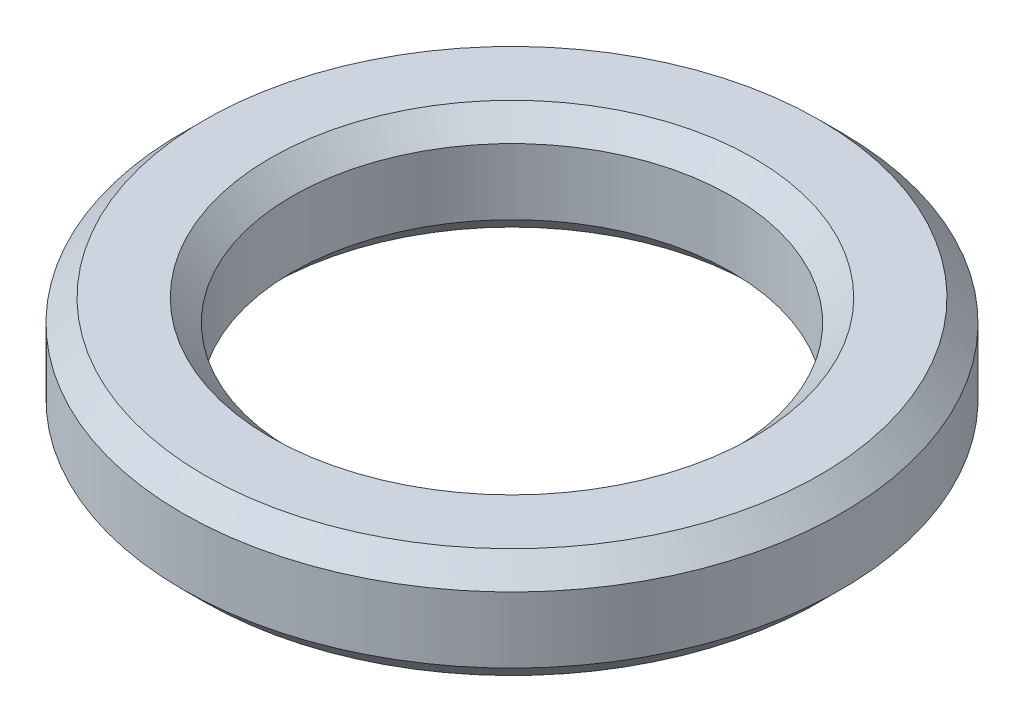
ISO-10303-21;
HEADER;
FILE_DESCRIPTION(('STEP AP214'),'2;1');
FILE_NAME('part.step','',(''),(''),'','','');
FILE_SCHEMA(('AUTOMOTIVE_DESIGN { 1 0 10303 214 1 1 1 1 }'));
ENDSEC;
DATA;
#1=APPLICATION_CONTEXT('core data for automotive mechanical design processes');
#2=APPLICATION_PROTOCOL_DEFINITION('international standard','automotive_design',2000,#1);
#3=PRODUCT_CONTEXT('',#1,'mechanical');
#4=PRODUCT('Part','Part','',(#3));
#5=PRODUCT_RELATED_PRODUCT_CATEGORY('part','',(#4));
#6=PRODUCT_DEFINITION_FORMATION('','',#4);
#7=PRODUCT_DEFINITION_CONTEXT('part definition',#1,'design');
#8=PRODUCT_DEFINITION('design','',#6,#7);
#9=PRODUCT_DEFINITION_SHAPE('','',#8);
#10=(LENGTH_UNIT() NAMED_UNIT(*) SI_UNIT(.MILLI.,.METRE.));
#11=(NAMED_UNIT(*) PLANE_ANGLE_UNIT() SI_UNIT($,.RADIAN.));
#12=(NAMED_UNIT(*) SI_UNIT($,.STERADIAN.) SOLID_ANGLE_UNIT());
#13=UNCERTAINTY_MEASURE_WITH_UNIT(LENGTH_MEASURE(1.E-05),#10,'distance_accuracy_value','');
#14=(GEOMETRIC_REPRESENTATION_CONTEXT(3) GLOBAL_UNCERTAINTY_ASSIGNED_CONTEXT((#13)) GLOBAL_UNIT_ASSIGNED_CONTEXT((#10,
#11,#12)) REPRESENTATION_CONTEXT('',''));
#15=CARTESIAN_POINT('',(0.,0.,0.));
#16=DIRECTION('',(0.,0.,1.));
#17=DIRECTION('',(1.,0.,0.));
#18=AXIS2_PLACEMENT_3D('',#15,#16,#17);
#19=CARTESIAN_POINT('',(0.,5.,0.));
#20=DIRECTION('',(0.,1.,0.));
#21=DIRECTION('',(0.,0.,1.));
#22=AXIS2_PLACEMENT_3D('',#19,#20,#21);
#23=PLANE('',#22);
#24=CARTESIAN_POINT('',(0.,5.,0.));
#25=DIRECTION('',(0.,1.,0.));
#26=DIRECTION('',(0.,0.,1.));
#27=AXIS2_PLACEMENT_3D('',#24,#25,#26);
#28=CIRCLE('',#27,11.);
#29=CARTESIAN_POINT('',(0.,5.,11.));
#30=VERTEX_POINT('',#29);
#31=EDGE_CURVE('E11',#30,#30,#28,.F.);
#32=ORIENTED_EDGE('',*,*,#31,.T.);
#33=EDGE_LOOP('',(#32));
#34=FACE_BOUND('',#33,.T.);
#35=CARTESIAN_POINT('',(0.,5.,0.));
#36=DIRECTION('',(0.,1.,0.));
#37=DIRECTION('',(0.,0.,1.));
#38=AXIS2_PLACEMENT_3D('',#35,#36,#37);
#39=CIRCLE('',#38,14.);
#40=CARTESIAN_POINT('',(0.,5.,14.));
#41=VERTEX_POINT('',#40);
#42=EDGE_CURVE('E47',#41,#41,#39,.T.);
#43=ORIENTED_EDGE('',*,*,#42,.T.);
#44=EDGE_LOOP('',(#43));
#45=FACE_BOUND('',#44,.T.);
#46=ADVANCED_FACE('F39',(#34,#45),#23,.T.);
#47=CARTESIAN_POINT('',(0.,0.,0.));
#48=DIRECTION('',(0.,1.,0.));
#49=DIRECTION('',(0.,0.,1.));
#50=AXIS2_PLACEMENT_3D('',#47,#48,#49);
#51=PLANE('',#50);
#52=CARTESIAN_POINT('',(0.,0.,0.));
#53=DIRECTION('',(0.,1.,0.));
#54=DIRECTION('',(0.,0.,1.));
#55=AXIS2_PLACEMENT_3D('',#52,#53,#54);
#56=CIRCLE('',#55,11.);
#57=CARTESIAN_POINT('',(0.,0.,11.));
#58=VERTEX_POINT('',#57);
#59=EDGE_CURVE('E66',#58,#58,#56,.T.);
#60=ORIENTED_EDGE('',*,*,#59,.T.);
#61=EDGE_LOOP('',(#60));
#62=FACE_BOUND('',#61,.T.);
#63=CARTESIAN_POINT('',(0.,0.,0.));
#64=DIRECTION('',(0.,1.,0.));
#65=DIRECTION('',(0.,0.,1.));
#66=AXIS2_PLACEMENT_3D('',#63,#64,#65);
#67=CIRCLE('',#66,14.);
#68=CARTESIAN_POINT('',(0.,0.,14.));
#69=VERTEX_POINT('',#68);
#70=EDGE_CURVE('E69',#69,#69,#67,.F.);
#71=ORIENTED_EDGE('',*,*,#70,.T.);
#72=EDGE_LOOP('',(#71));
#73=FACE_BOUND('',#72,.T.);
#74=ADVANCED_FACE('F73',(#62,#73),#51,.F.);
#75=CARTESIAN_POINT('',(0.,5.,0.));
#76=DIRECTION('',(0.,-1.,0.));
#77=DIRECTION('',(0.,0.,-1.));
#78=AXIS2_PLACEMENT_3D('',#75,#76,#77);
#79=CYLINDRICAL_SURFACE('',#78,15.);
#80=CARTESIAN_POINT('',(0.,0.999999999999996,0.));
#81=DIRECTION('',(0.,1.,0.));
#82=DIRECTION('',(0.,0.,1.));
#83=AXIS2_PLACEMENT_3D('',#80,#81,#82);
#84=CIRCLE('',#83,15.);
#85=CARTESIAN_POINT('',(0.,0.999999999999996,15.));
#86=VERTEX_POINT('',#85);
#87=EDGE_CURVE('E51',#86,#86,#84,.T.);
#88=ORIENTED_EDGE('',*,*,#87,.T.);
#89=EDGE_LOOP('',(#88));
#90=FACE_BOUND('',#89,.T.);
#91=CARTESIAN_POINT('',(0.,4.,0.));
#92=DIRECTION('',(0.,1.,0.));
#93=DIRECTION('',(0.,0.,1.));
#94=AXIS2_PLACEMENT_3D('',#91,#92,#93);
#95=CIRCLE('',#94,15.);
#96=CARTESIAN_POINT('',(0.,4.,15.));
#97=VERTEX_POINT('',#96);
#98=EDGE_CURVE('E55',#97,#97,#95,.F.);
#99=ORIENTED_EDGE('',*,*,#98,.T.);
#100=EDGE_LOOP('',(#99));
#101=FACE_BOUND('',#100,.T.);
#102=ADVANCED_FACE('F83',(#90,#101),#79,.T.);
#103=CARTESIAN_POINT('',(0.,5.,0.));
#104=DIRECTION('',(0.,-1.,0.));
#105=DIRECTION('',(0.,0.,-1.));
#106=AXIS2_PLACEMENT_3D('',#103,#104,#105);
#107=CYLINDRICAL_SURFACE('',#106,10.);
#108=CARTESIAN_POINT('',(0.,1.,0.));
#109=DIRECTION('',(0.,1.,0.));
#110=DIRECTION('',(0.,0.,1.));
#111=AXIS2_PLACEMENT_3D('',#108,#109,#110);
#112=CIRCLE('',#111,10.);
#113=CARTESIAN_POINT('',(0.,1.,10.));
#114=VERTEX_POINT('',#113);
#115=EDGE_CURVE('E60',#114,#114,#112,.F.);
#116=ORIENTED_EDGE('',*,*,#115,.T.);
#117=EDGE_LOOP('',(#116));
#118=FACE_BOUND('',#117,.T.);
#119=CARTESIAN_POINT('',(0.,4.,0.));
#120=DIRECTION('',(0.,1.,0.));
#121=DIRECTION('',(0.,0.,1.));
#122=AXIS2_PLACEMENT_3D('',#119,#120,#121);
#123=CIRCLE('',#122,10.);
#124=CARTESIAN_POINT('',(0.,4.,10.));
#125=VERTEX_POINT('',#124);
#126=EDGE_CURVE('E63',#125,#125,#123,.T.);
#127=ORIENTED_EDGE('',*,*,#126,.T.);
#128=EDGE_LOOP('',(#127));
#129=FACE_BOUND('',#128,.T.);
#130=ADVANCED_FACE('F86',(#118,#129),#107,.F.);
#131=CARTESIAN_POINT('',(0.,0.,0.));
#132=DIRECTION('',(0.,-1.,0.));
#133=DIRECTION('',(0.,0.,-1.));
#134=AXIS2_PLACEMENT_3D('',#131,#132,#133);
#135=CONICAL_SURFACE('',#134,11.,0.785398163397447);
#136=ORIENTED_EDGE('',*,*,#115,.F.);
#137=EDGE_LOOP('',(#136));
#138=FACE_BOUND('',#137,.T.);
#139=ORIENTED_EDGE('',*,*,#59,.F.);
#140=EDGE_LOOP('',(#139));
#141=FACE_BOUND('',#140,.T.);
#142=ADVANCED_FACE('F79',(#138,#141),#135,.F.);
#143=CARTESIAN_POINT('',(0.,0.999999999999996,0.));
#144=DIRECTION('',(0.,1.,0.));
#145=DIRECTION('',(0.,0.,1.));
#146=AXIS2_PLACEMENT_3D('',#143,#144,#145);
#147=CONICAL_SURFACE('',#146,15.,0.78539816339745);
#148=ORIENTED_EDGE('',*,*,#70,.F.);
#149=EDGE_LOOP('',(#148));
#150=FACE_BOUND('',#149,.T.);
#151=ORIENTED_EDGE('',*,*,#87,.F.);
#152=EDGE_LOOP('',(#151));
#153=FACE_BOUND('',#152,.T.);
#154=ADVANCED_FACE('F75',(#150,#153),#147,.T.);
#155=CARTESIAN_POINT('',(0.,4.,0.));
#156=DIRECTION('',(0.,1.,0.));
#157=DIRECTION('',(0.,0.,1.));
#158=AXIS2_PLACEMENT_3D('',#155,#156,#157);
#159=CONICAL_SURFACE('',#158,10.,0.785398163397448);
#160=ORIENTED_EDGE('',*,*,#31,.F.);
#161=EDGE_LOOP('',(#160));
#162=FACE_BOUND('',#161,.T.);
#163=ORIENTED_EDGE('',*,*,#126,.F.);
#164=EDGE_LOOP('',(#163));
#165=FACE_BOUND('',#164,.T.);
#166=ADVANCED_FACE('F78',(#162,#165),#159,.F.);
#167=CARTESIAN_POINT('',(0.,5.,0.));
#168=DIRECTION('',(0.,-1.,0.));
#169=DIRECTION('',(0.,0.,-1.));
#170=AXIS2_PLACEMENT_3D('',#167,#168,#169);
#171=CONICAL_SURFACE('',#170,14.,0.785398163397446);
#172=ORIENTED_EDGE('',*,*,#98,.F.);
#173=EDGE_LOOP('',(#172));
#174=FACE_BOUND('',#173,.T.);
#175=ORIENTED_EDGE('',*,*,#42,.F.);
#176=EDGE_LOOP('',(#175));
#177=FACE_BOUND('',#176,.T.);
#178=ADVANCED_FACE('F42',(#174,#177),#171,.T.);
#179=CLOSED_SHELL('',(#46,#74,#102,#130,#142,#154,#166,#178));
#180=MANIFOLD_SOLID_BREP('B2',#179);
#181=ADVANCED_BREP_SHAPE_REPRESENTATION('',(#18,#180),#14);
#182=SHAPE_DEFINITION_REPRESENTATION(#9,#181);
ENDSEC;
END-ISO-10303-21;
